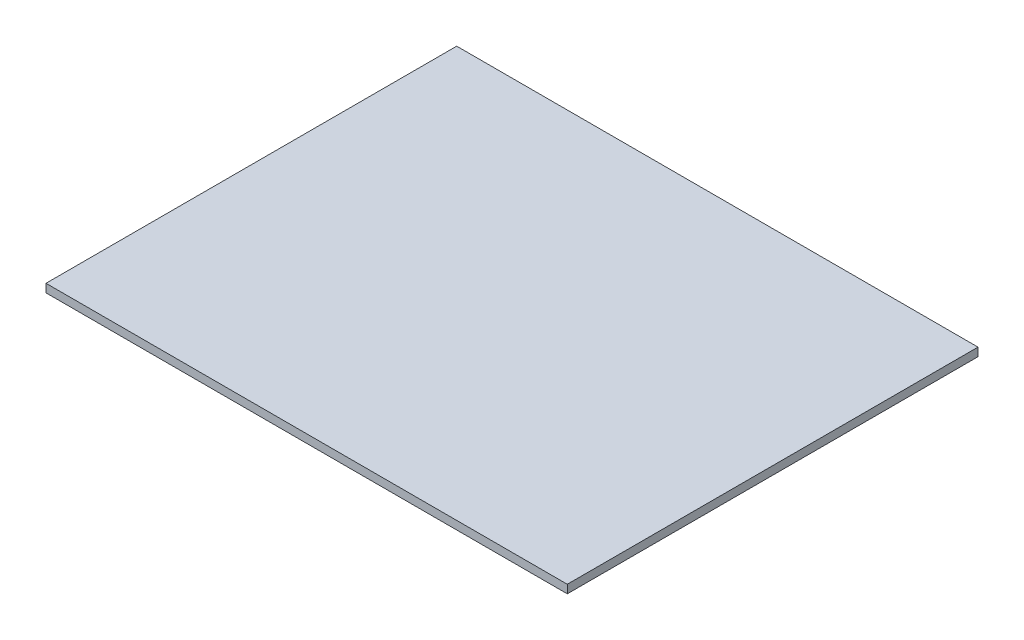
ISO-10303-21;
HEADER;
FILE_DESCRIPTION(('STEP AP214'),'2;1');
FILE_NAME('part.step','',(''),(''),'','','');
FILE_SCHEMA(('AUTOMOTIVE_DESIGN { 1 0 10303 214 1 1 1 1 }'));
ENDSEC;
DATA;
#1=APPLICATION_CONTEXT('core data for automotive mechanical design processes');
#2=APPLICATION_PROTOCOL_DEFINITION('international standard','automotive_design',2000,#1);
#3=PRODUCT_CONTEXT('',#1,'mechanical');
#4=PRODUCT('Part','Part','',(#3));
#5=PRODUCT_RELATED_PRODUCT_CATEGORY('part','',(#4));
#6=PRODUCT_DEFINITION_FORMATION('','',#4);
#7=PRODUCT_DEFINITION_CONTEXT('part definition',#1,'design');
#8=PRODUCT_DEFINITION('design','',#6,#7);
#9=PRODUCT_DEFINITION_SHAPE('','',#8);
#10=(LENGTH_UNIT() NAMED_UNIT(*) SI_UNIT(.MILLI.,.METRE.));
#11=(NAMED_UNIT(*) PLANE_ANGLE_UNIT() SI_UNIT($,.RADIAN.));
#12=(NAMED_UNIT(*) SI_UNIT($,.STERADIAN.) SOLID_ANGLE_UNIT());
#13=UNCERTAINTY_MEASURE_WITH_UNIT(LENGTH_MEASURE(1.E-05),#10,'distance_accuracy_value','');
#14=(GEOMETRIC_REPRESENTATION_CONTEXT(3) GLOBAL_UNCERTAINTY_ASSIGNED_CONTEXT((#13)) GLOBAL_UNIT_ASSIGNED_CONTEXT((#10,
#11,#12)) REPRESENTATION_CONTEXT('',''));
#15=CARTESIAN_POINT('',(0.,0.,0.));
#16=DIRECTION('',(0.,0.,1.));
#17=DIRECTION('',(1.,0.,0.));
#18=AXIS2_PLACEMENT_3D('',#15,#16,#17);
#19=CARTESIAN_POINT('',(-49.5,0.79,-39.));
#20=DIRECTION('',(1.,0.,0.));
#21=DIRECTION('',(0.,0.,-1.));
#22=AXIS2_PLACEMENT_3D('',#19,#20,#21);
#23=PLANE('',#22);
#24=DIRECTION('',(0.,0.,1.));
#25=VECTOR('',#24,1.);
#26=CARTESIAN_POINT('',(-49.5,-0.79,-39.));
#27=LINE('',#26,#25);
#28=CARTESIAN_POINT('',(-49.5,-0.79,-39.));
#29=VERTEX_POINT('',#28);
#30=CARTESIAN_POINT('',(-49.5,-0.79,39.));
#31=VERTEX_POINT('',#30);
#32=EDGE_CURVE('E98',#29,#31,#27,.T.);
#33=ORIENTED_EDGE('',*,*,#32,.T.);
#34=DIRECTION('',(0.,-1.,0.));
#35=VECTOR('',#34,1.);
#36=CARTESIAN_POINT('',(-49.5,0.79,39.));
#37=LINE('',#36,#35);
#38=CARTESIAN_POINT('',(-49.5,0.79,39.));
#39=VERTEX_POINT('',#38);
#40=EDGE_CURVE('E11',#39,#31,#37,.T.);
#41=ORIENTED_EDGE('',*,*,#40,.F.);
#42=DIRECTION('',(0.,0.,1.));
#43=VECTOR('',#42,1.);
#44=CARTESIAN_POINT('',(-49.5,0.79,-39.));
#45=LINE('',#44,#43);
#46=CARTESIAN_POINT('',(-49.5,0.79,-39.));
#47=VERTEX_POINT('',#46);
#48=EDGE_CURVE('E86',#47,#39,#45,.T.);
#49=ORIENTED_EDGE('',*,*,#48,.F.);
#50=DIRECTION('',(0.,-1.,0.));
#51=VECTOR('',#50,1.);
#52=CARTESIAN_POINT('',(-49.5,0.79,-39.));
#53=LINE('',#52,#51);
#54=EDGE_CURVE('E94',#47,#29,#53,.T.);
#55=ORIENTED_EDGE('',*,*,#54,.T.);
#56=EDGE_LOOP('',(#33,#41,#49,#55));
#57=FACE_BOUND('',#56,.T.);
#58=ADVANCED_FACE('F35',(#57),#23,.F.);
#59=CARTESIAN_POINT('',(-49.5,0.79,39.));
#60=DIRECTION('',(0.,0.,-1.));
#61=DIRECTION('',(-1.,0.,0.));
#62=AXIS2_PLACEMENT_3D('',#59,#60,#61);
#63=PLANE('',#62);
#64=DIRECTION('',(1.,0.,0.));
#65=VECTOR('',#64,1.);
#66=CARTESIAN_POINT('',(-49.5,-0.79,39.));
#67=LINE('',#66,#65);
#68=CARTESIAN_POINT('',(49.5,-0.79,39.));
#69=VERTEX_POINT('',#68);
#70=EDGE_CURVE('E90',#31,#69,#67,.T.);
#71=ORIENTED_EDGE('',*,*,#70,.T.);
#72=DIRECTION('',(0.,-1.,0.));
#73=VECTOR('',#72,1.);
#74=CARTESIAN_POINT('',(49.5,0.79,39.));
#75=LINE('',#74,#73);
#76=CARTESIAN_POINT('',(49.5,0.79,39.));
#77=VERTEX_POINT('',#76);
#78=EDGE_CURVE('E43',#77,#69,#75,.T.);
#79=ORIENTED_EDGE('',*,*,#78,.F.);
#80=DIRECTION('',(1.,0.,0.));
#81=VECTOR('',#80,1.);
#82=CARTESIAN_POINT('',(-49.5,0.79,39.));
#83=LINE('',#82,#81);
#84=EDGE_CURVE('E81',#39,#77,#83,.T.);
#85=ORIENTED_EDGE('',*,*,#84,.F.);
#86=ORIENTED_EDGE('',*,*,#40,.T.);
#87=EDGE_LOOP('',(#71,#79,#85,#86));
#88=FACE_BOUND('',#87,.T.);
#89=ADVANCED_FACE('F89',(#88),#63,.F.);
#90=CARTESIAN_POINT('',(49.5,0.79,-39.));
#91=DIRECTION('',(-1.,0.,0.));
#92=DIRECTION('',(0.,0.,1.));
#93=AXIS2_PLACEMENT_3D('',#90,#91,#92);
#94=PLANE('',#93);
#95=DIRECTION('',(0.,0.,-1.));
#96=VECTOR('',#95,1.);
#97=CARTESIAN_POINT('',(49.5,-0.79,-39.));
#98=LINE('',#97,#96);
#99=CARTESIAN_POINT('',(49.5,-0.79,-39.));
#100=VERTEX_POINT('',#99);
#101=EDGE_CURVE('E68',#69,#100,#98,.T.);
#102=ORIENTED_EDGE('',*,*,#101,.T.);
#103=DIRECTION('',(0.,-1.,0.));
#104=VECTOR('',#103,1.);
#105=CARTESIAN_POINT('',(49.5,0.79,-39.));
#106=LINE('',#105,#104);
#107=CARTESIAN_POINT('',(49.5,0.79,-39.));
#108=VERTEX_POINT('',#107);
#109=EDGE_CURVE('E91',#108,#100,#106,.T.);
#110=ORIENTED_EDGE('',*,*,#109,.F.);
#111=DIRECTION('',(0.,0.,-1.));
#112=VECTOR('',#111,1.);
#113=CARTESIAN_POINT('',(49.5,0.79,-39.));
#114=LINE('',#113,#112);
#115=EDGE_CURVE('E84',#77,#108,#114,.T.);
#116=ORIENTED_EDGE('',*,*,#115,.F.);
#117=ORIENTED_EDGE('',*,*,#78,.T.);
#118=EDGE_LOOP('',(#102,#110,#116,#117));
#119=FACE_BOUND('',#118,.T.);
#120=ADVANCED_FACE('F92',(#119),#94,.F.);
#121=CARTESIAN_POINT('',(-49.5,0.79,-39.));
#122=DIRECTION('',(0.,0.,1.));
#123=DIRECTION('',(1.,0.,0.));
#124=AXIS2_PLACEMENT_3D('',#121,#122,#123);
#125=PLANE('',#124);
#126=DIRECTION('',(-1.,0.,0.));
#127=VECTOR('',#126,1.);
#128=CARTESIAN_POINT('',(-49.5,-0.79,-39.));
#129=LINE('',#128,#127);
#130=EDGE_CURVE('E74',#100,#29,#129,.T.);
#131=ORIENTED_EDGE('',*,*,#130,.T.);
#132=ORIENTED_EDGE('',*,*,#54,.F.);
#133=DIRECTION('',(-1.,0.,0.));
#134=VECTOR('',#133,1.);
#135=CARTESIAN_POINT('',(-49.5,0.79,-39.));
#136=LINE('',#135,#134);
#137=EDGE_CURVE('E51',#108,#47,#136,.T.);
#138=ORIENTED_EDGE('',*,*,#137,.F.);
#139=ORIENTED_EDGE('',*,*,#109,.T.);
#140=EDGE_LOOP('',(#131,#132,#138,#139));
#141=FACE_BOUND('',#140,.T.);
#142=ADVANCED_FACE('F105',(#141),#125,.F.);
#143=CARTESIAN_POINT('',(0.,0.79,0.));
#144=DIRECTION('',(0.,1.,0.));
#145=DIRECTION('',(0.,0.,1.));
#146=AXIS2_PLACEMENT_3D('',#143,#144,#145);
#147=PLANE('',#146);
#148=ORIENTED_EDGE('',*,*,#48,.T.);
#149=ORIENTED_EDGE('',*,*,#84,.T.);
#150=ORIENTED_EDGE('',*,*,#115,.T.);
#151=ORIENTED_EDGE('',*,*,#137,.T.);
#152=EDGE_LOOP('',(#148,#149,#150,#151));
#153=FACE_BOUND('',#152,.T.);
#154=ADVANCED_FACE('F82',(#153),#147,.T.);
#155=CARTESIAN_POINT('',(0.,-0.79,0.));
#156=DIRECTION('',(0.,1.,0.));
#157=DIRECTION('',(0.,0.,1.));
#158=AXIS2_PLACEMENT_3D('',#155,#156,#157);
#159=PLANE('',#158);
#160=ORIENTED_EDGE('',*,*,#32,.F.);
#161=ORIENTED_EDGE('',*,*,#130,.F.);
#162=ORIENTED_EDGE('',*,*,#101,.F.);
#163=ORIENTED_EDGE('',*,*,#70,.F.);
#164=EDGE_LOOP('',(#160,#161,#162,#163));
#165=FACE_BOUND('',#164,.T.);
#166=ADVANCED_FACE('F108',(#165),#159,.F.);
#167=CLOSED_SHELL('',(#58,#89,#120,#142,#154,#166));
#168=MANIFOLD_SOLID_BREP('B2',#167);
#169=ADVANCED_BREP_SHAPE_REPRESENTATION('',(#18,#168),#14);
#170=SHAPE_DEFINITION_REPRESENTATION(#9,#169);
ENDSEC;
END-ISO-10303-21;
